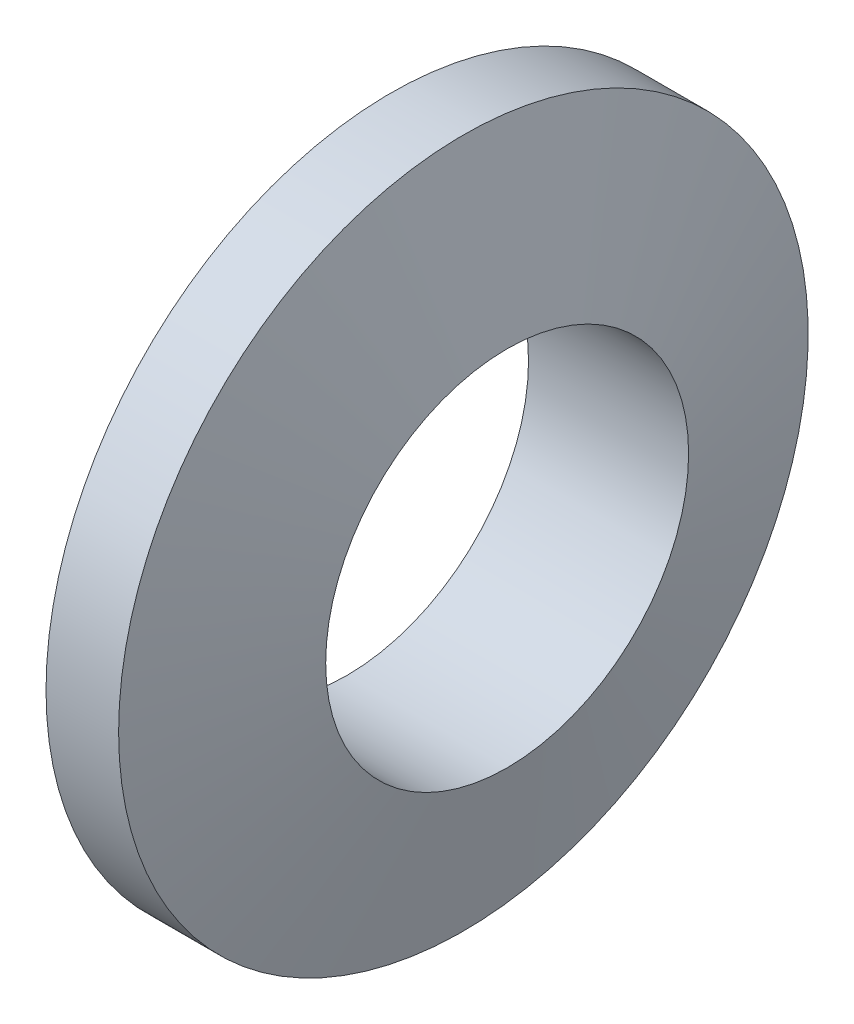
ISO-10303-21;
HEADER;
FILE_DESCRIPTION(('STEP AP214'),'2;1');
FILE_NAME('part.step','',(''),(''),'','','');
FILE_SCHEMA(('AUTOMOTIVE_DESIGN { 1 0 10303 214 1 1 1 1 }'));
ENDSEC;
DATA;
#1=APPLICATION_CONTEXT('core data for automotive mechanical design processes');
#2=APPLICATION_PROTOCOL_DEFINITION('international standard','automotive_design',2000,#1);
#3=PRODUCT_CONTEXT('',#1,'mechanical');
#4=PRODUCT('Part','Part','',(#3));
#5=PRODUCT_RELATED_PRODUCT_CATEGORY('part','',(#4));
#6=PRODUCT_DEFINITION_FORMATION('','',#4);
#7=PRODUCT_DEFINITION_CONTEXT('part definition',#1,'design');
#8=PRODUCT_DEFINITION('design','',#6,#7);
#9=PRODUCT_DEFINITION_SHAPE('','',#8);
#10=(LENGTH_UNIT() NAMED_UNIT(*) SI_UNIT(.MILLI.,.METRE.));
#11=(NAMED_UNIT(*) PLANE_ANGLE_UNIT() SI_UNIT($,.RADIAN.));
#12=(NAMED_UNIT(*) SI_UNIT($,.STERADIAN.) SOLID_ANGLE_UNIT());
#13=UNCERTAINTY_MEASURE_WITH_UNIT(LENGTH_MEASURE(1.E-05),#10,'distance_accuracy_value','');
#14=(GEOMETRIC_REPRESENTATION_CONTEXT(3) GLOBAL_UNCERTAINTY_ASSIGNED_CONTEXT((#13)) GLOBAL_UNIT_ASSIGNED_CONTEXT((#10,
#11,#12)) REPRESENTATION_CONTEXT('',''));
#15=CARTESIAN_POINT('',(0.,0.,0.));
#16=DIRECTION('',(0.,0.,1.));
#17=DIRECTION('',(1.,0.,0.));
#18=AXIS2_PLACEMENT_3D('',#15,#16,#17);
#19=CARTESIAN_POINT('',(-0.999999999999999,0.,0.));
#20=DIRECTION('',(1.,0.,0.));
#21=DIRECTION('',(0.,0.,-1.));
#22=AXIS2_PLACEMENT_3D('',#19,#20,#21);
#23=CONICAL_SURFACE('',#22,9.5,1.30899693899575);
#24=CARTESIAN_POINT('',(-2.20577136594005,0.,0.));
#25=DIRECTION('',(-1.,0.,0.));
#26=DIRECTION('',(0.,0.,1.));
#27=AXIS2_PLACEMENT_3D('',#24,#25,#26);
#28=CIRCLE('',#27,5.);
#29=CARTESIAN_POINT('',(-2.20577136594005,0.,5.));
#30=VERTEX_POINT('',#29);
#31=EDGE_CURVE('E10',#30,#30,#28,.T.);
#32=ORIENTED_EDGE('',*,*,#31,.F.);
#33=EDGE_LOOP('',(#32));
#34=FACE_BOUND('',#33,.T.);
#35=CARTESIAN_POINT('',(-0.999999999999999,0.,0.));
#36=DIRECTION('',(-1.,0.,0.));
#37=DIRECTION('',(0.,0.,1.));
#38=AXIS2_PLACEMENT_3D('',#35,#36,#37);
#39=CIRCLE('',#38,9.5);
#40=CARTESIAN_POINT('',(-0.999999999999999,0.,9.5));
#41=VERTEX_POINT('',#40);
#42=EDGE_CURVE('E48',#41,#41,#39,.T.);
#43=ORIENTED_EDGE('',*,*,#42,.T.);
#44=EDGE_LOOP('',(#43));
#45=FACE_BOUND('',#44,.T.);
#46=ADVANCED_FACE('F34',(#34,#45),#23,.T.);
#47=CARTESIAN_POINT('',(-10.,0.,0.));
#48=DIRECTION('',(-1.,0.,0.));
#49=DIRECTION('',(0.,0.,1.));
#50=AXIS2_PLACEMENT_3D('',#47,#48,#49);
#51=CYLINDRICAL_SURFACE('',#50,5.);
#52=CARTESIAN_POINT('',(2.20577136594005,0.,0.));
#53=DIRECTION('',(-1.,0.,0.));
#54=DIRECTION('',(0.,0.,1.));
#55=AXIS2_PLACEMENT_3D('',#52,#53,#54);
#56=CIRCLE('',#55,5.);
#57=CARTESIAN_POINT('',(2.20577136594005,0.,5.));
#58=VERTEX_POINT('',#57);
#59=EDGE_CURVE('E40',#58,#58,#56,.T.);
#60=ORIENTED_EDGE('',*,*,#59,.F.);
#61=EDGE_LOOP('',(#60));
#62=FACE_BOUND('',#61,.T.);
#63=ORIENTED_EDGE('',*,*,#31,.T.);
#64=EDGE_LOOP('',(#63));
#65=FACE_BOUND('',#64,.T.);
#66=ADVANCED_FACE('F63',(#62,#65),#51,.F.);
#67=CARTESIAN_POINT('',(2.20577136594005,0.,0.));
#68=DIRECTION('',(-1.,0.,0.));
#69=DIRECTION('',(0.,0.,1.));
#70=AXIS2_PLACEMENT_3D('',#67,#68,#69);
#71=CONICAL_SURFACE('',#70,5.,1.30899693899575);
#72=CARTESIAN_POINT('',(0.999999999999999,0.,0.));
#73=DIRECTION('',(-1.,0.,0.));
#74=DIRECTION('',(0.,0.,1.));
#75=AXIS2_PLACEMENT_3D('',#72,#73,#74);
#76=CIRCLE('',#75,9.5);
#77=CARTESIAN_POINT('',(0.999999999999999,0.,9.5));
#78=VERTEX_POINT('',#77);
#79=EDGE_CURVE('E44',#78,#78,#76,.T.);
#80=ORIENTED_EDGE('',*,*,#79,.F.);
#81=EDGE_LOOP('',(#80));
#82=FACE_BOUND('',#81,.T.);
#83=ORIENTED_EDGE('',*,*,#59,.T.);
#84=EDGE_LOOP('',(#83));
#85=FACE_BOUND('',#84,.T.);
#86=ADVANCED_FACE('F58',(#82,#85),#71,.T.);
#87=CARTESIAN_POINT('',(-10.,0.,0.));
#88=DIRECTION('',(-1.,0.,0.));
#89=DIRECTION('',(0.,0.,1.));
#90=AXIS2_PLACEMENT_3D('',#87,#88,#89);
#91=CYLINDRICAL_SURFACE('',#90,9.5);
#92=ORIENTED_EDGE('',*,*,#42,.F.);
#93=EDGE_LOOP('',(#92));
#94=FACE_BOUND('',#93,.T.);
#95=ORIENTED_EDGE('',*,*,#79,.T.);
#96=EDGE_LOOP('',(#95));
#97=FACE_BOUND('',#96,.T.);
#98=ADVANCED_FACE('F55',(#94,#97),#91,.T.);
#99=CLOSED_SHELL('',(#46,#66,#86,#98));
#100=MANIFOLD_SOLID_BREP('B2',#99);
#101=ADVANCED_BREP_SHAPE_REPRESENTATION('',(#18,#100),#14);
#102=SHAPE_DEFINITION_REPRESENTATION(#9,#101);
ENDSEC;
END-ISO-10303-21;
